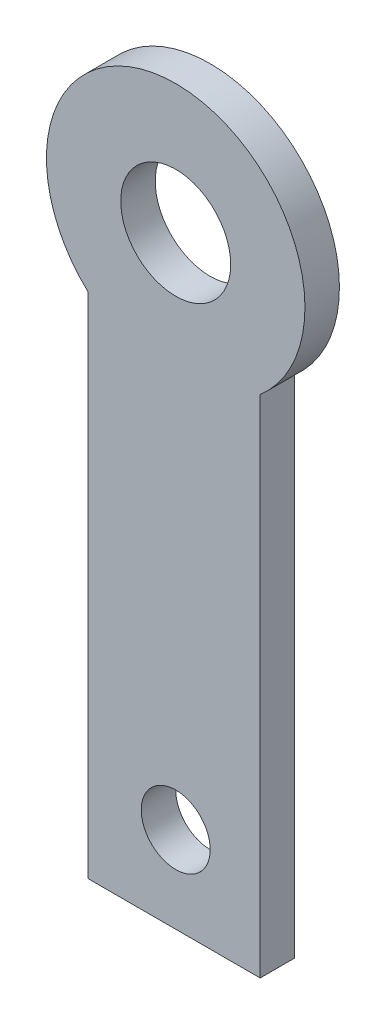
ISO-10303-21;
HEADER;
FILE_DESCRIPTION(('STEP AP214'),'2;1');
FILE_NAME('part.step','',(''),(''),'','','');
FILE_SCHEMA(('AUTOMOTIVE_DESIGN { 1 0 10303 214 1 1 1 1 }'));
ENDSEC;
DATA;
#1=APPLICATION_CONTEXT('core data for automotive mechanical design processes');
#2=APPLICATION_PROTOCOL_DEFINITION('international standard','automotive_design',2000,#1);
#3=PRODUCT_CONTEXT('',#1,'mechanical');
#4=PRODUCT('Part','Part','',(#3));
#5=PRODUCT_RELATED_PRODUCT_CATEGORY('part','',(#4));
#6=PRODUCT_DEFINITION_FORMATION('','',#4);
#7=PRODUCT_DEFINITION_CONTEXT('part definition',#1,'design');
#8=PRODUCT_DEFINITION('design','',#6,#7);
#9=PRODUCT_DEFINITION_SHAPE('','',#8);
#10=(LENGTH_UNIT() NAMED_UNIT(*) SI_UNIT(.MILLI.,.METRE.));
#11=(NAMED_UNIT(*) PLANE_ANGLE_UNIT() SI_UNIT($,.RADIAN.));
#12=(NAMED_UNIT(*) SI_UNIT($,.STERADIAN.) SOLID_ANGLE_UNIT());
#13=UNCERTAINTY_MEASURE_WITH_UNIT(LENGTH_MEASURE(1.E-05),#10,'distance_accuracy_value','');
#14=(GEOMETRIC_REPRESENTATION_CONTEXT(3) GLOBAL_UNCERTAINTY_ASSIGNED_CONTEXT((#13)) GLOBAL_UNIT_ASSIGNED_CONTEXT((#10,
#11,#12)) REPRESENTATION_CONTEXT('',''));
#15=CARTESIAN_POINT('',(0.,0.,0.));
#16=DIRECTION('',(0.,0.,1.));
#17=DIRECTION('',(1.,0.,0.));
#18=AXIS2_PLACEMENT_3D('',#15,#16,#17);
#19=CARTESIAN_POINT('',(15.5,8.,1.));
#20=DIRECTION('',(0.,0.,-1.));
#21=DIRECTION('',(-1.,0.,0.));
#22=AXIS2_PLACEMENT_3D('',#19,#20,#21);
#23=PLANE('',#22);
#24=CARTESIAN_POINT('',(15.5,8.,1.));
#25=DIRECTION('',(0.,0.,1.));
#26=DIRECTION('',(-1.,0.,0.));
#27=AXIS2_PLACEMENT_3D('',#24,#25,#26);
#28=CIRCLE('',#27,3.75);
#29=CARTESIAN_POINT('',(17.9502977305398,5.16124304814384,1.));
#30=VERTEX_POINT('',#29);
#31=CARTESIAN_POINT('',(12.9502977305398,5.25017848995442,1.));
#32=VERTEX_POINT('',#31);
#33=EDGE_CURVE('E87',#30,#32,#28,.T.);
#34=ORIENTED_EDGE('',*,*,#33,.T.);
#35=DIRECTION('',(0.,-1.,0.));
#36=VECTOR('',#35,1.);
#37=CARTESIAN_POINT('',(12.9502977305398,5.25017848995442,1.));
#38=LINE('',#37,#36);
#39=CARTESIAN_POINT('',(12.9502977305398,-9.5,1.));
#40=VERTEX_POINT('',#39);
#41=EDGE_CURVE('E82',#32,#40,#38,.T.);
#42=ORIENTED_EDGE('',*,*,#41,.T.);
#43=DIRECTION('',(1.,0.,0.));
#44=VECTOR('',#43,1.);
#45=CARTESIAN_POINT('',(12.9502977305398,-9.5,1.));
#46=LINE('',#45,#44);
#47=CARTESIAN_POINT('',(17.9502977305398,-9.5,1.));
#48=VERTEX_POINT('',#47);
#49=EDGE_CURVE('E85',#40,#48,#46,.T.);
#50=ORIENTED_EDGE('',*,*,#49,.T.);
#51=DIRECTION('',(0.,1.,0.));
#52=VECTOR('',#51,1.);
#53=CARTESIAN_POINT('',(17.9502977305398,-9.5,1.));
#54=LINE('',#53,#52);
#55=EDGE_CURVE('E52',#48,#30,#54,.T.);
#56=ORIENTED_EDGE('',*,*,#55,.T.);
#57=EDGE_LOOP('',(#34,#42,#50,#56));
#58=FACE_BOUND('',#57,.T.);
#59=CARTESIAN_POINT('',(15.5,8.,1.));
#60=DIRECTION('',(0.,0.,1.));
#61=DIRECTION('',(1.,0.,0.));
#62=AXIS2_PLACEMENT_3D('',#59,#60,#61);
#63=CIRCLE('',#62,1.595);
#64=CARTESIAN_POINT('',(17.095,8.,1.));
#65=VERTEX_POINT('',#64);
#66=EDGE_CURVE('E102',#65,#65,#63,.T.);
#67=ORIENTED_EDGE('',*,*,#66,.F.);
#68=EDGE_LOOP('',(#67));
#69=FACE_BOUND('',#68,.T.);
#70=CARTESIAN_POINT('',(15.5,-7.,1.));
#71=DIRECTION('',(0.,0.,1.));
#72=DIRECTION('',(1.,0.,0.));
#73=AXIS2_PLACEMENT_3D('',#70,#71,#72);
#74=CIRCLE('',#73,1.);
#75=CARTESIAN_POINT('',(16.5,-7.,1.));
#76=VERTEX_POINT('',#75);
#77=EDGE_CURVE('E117',#76,#76,#74,.T.);
#78=ORIENTED_EDGE('',*,*,#77,.F.);
#79=EDGE_LOOP('',(#78));
#80=FACE_BOUND('',#79,.T.);
#81=ADVANCED_FACE('F35',(#58,#69,#80),#23,.F.);
#82=CARTESIAN_POINT('',(15.5,8.,0.));
#83=DIRECTION('',(0.,0.,-1.));
#84=DIRECTION('',(-1.,0.,0.));
#85=AXIS2_PLACEMENT_3D('',#82,#83,#84);
#86=PLANE('',#85);
#87=CARTESIAN_POINT('',(15.5,8.,0.));
#88=DIRECTION('',(0.,0.,1.));
#89=DIRECTION('',(1.,0.,0.));
#90=AXIS2_PLACEMENT_3D('',#87,#88,#89);
#91=CIRCLE('',#90,1.595);
#92=CARTESIAN_POINT('',(17.095,8.,0.));
#93=VERTEX_POINT('',#92);
#94=EDGE_CURVE('E114',#93,#93,#91,.T.);
#95=ORIENTED_EDGE('',*,*,#94,.T.);
#96=EDGE_LOOP('',(#95));
#97=FACE_BOUND('',#96,.T.);
#98=CARTESIAN_POINT('',(15.5,8.,0.));
#99=DIRECTION('',(0.,0.,1.));
#100=DIRECTION('',(-1.,0.,0.));
#101=AXIS2_PLACEMENT_3D('',#98,#99,#100);
#102=CIRCLE('',#101,3.75);
#103=CARTESIAN_POINT('',(17.9502977305398,5.16124304814384,0.));
#104=VERTEX_POINT('',#103);
#105=CARTESIAN_POINT('',(12.9502977305398,5.25017848995442,0.));
#106=VERTEX_POINT('',#105);
#107=EDGE_CURVE('E99',#104,#106,#102,.T.);
#108=ORIENTED_EDGE('',*,*,#107,.F.);
#109=DIRECTION('',(0.,1.,0.));
#110=VECTOR('',#109,1.);
#111=CARTESIAN_POINT('',(17.9502977305398,-9.5,0.));
#112=LINE('',#111,#110);
#113=CARTESIAN_POINT('',(17.9502977305398,-9.5,0.));
#114=VERTEX_POINT('',#113);
#115=EDGE_CURVE('E75',#114,#104,#112,.T.);
#116=ORIENTED_EDGE('',*,*,#115,.F.);
#117=DIRECTION('',(1.,0.,0.));
#118=VECTOR('',#117,1.);
#119=CARTESIAN_POINT('',(12.9502977305398,-9.5,0.));
#120=LINE('',#119,#118);
#121=CARTESIAN_POINT('',(12.9502977305398,-9.5,0.));
#122=VERTEX_POINT('',#121);
#123=EDGE_CURVE('E69',#122,#114,#120,.T.);
#124=ORIENTED_EDGE('',*,*,#123,.F.);
#125=DIRECTION('',(0.,-1.,0.));
#126=VECTOR('',#125,1.);
#127=CARTESIAN_POINT('',(12.9502977305398,5.25017848995442,0.));
#128=LINE('',#127,#126);
#129=EDGE_CURVE('E91',#106,#122,#128,.T.);
#130=ORIENTED_EDGE('',*,*,#129,.F.);
#131=EDGE_LOOP('',(#108,#116,#124,#130));
#132=FACE_BOUND('',#131,.T.);
#133=CARTESIAN_POINT('',(15.5,-7.,0.));
#134=DIRECTION('',(0.,0.,1.));
#135=DIRECTION('',(1.,0.,0.));
#136=AXIS2_PLACEMENT_3D('',#133,#134,#135);
#137=CIRCLE('',#136,1.);
#138=CARTESIAN_POINT('',(16.5,-7.,0.));
#139=VERTEX_POINT('',#138);
#140=EDGE_CURVE('E120',#139,#139,#137,.T.);
#141=ORIENTED_EDGE('',*,*,#140,.T.);
#142=EDGE_LOOP('',(#141));
#143=FACE_BOUND('',#142,.T.);
#144=ADVANCED_FACE('F110',(#97,#132,#143),#86,.T.);
#145=CARTESIAN_POINT('',(15.5,8.,1.));
#146=DIRECTION('',(0.,0.,-1.));
#147=DIRECTION('',(-1.,0.,0.));
#148=AXIS2_PLACEMENT_3D('',#145,#146,#147);
#149=CYLINDRICAL_SURFACE('',#148,3.75);
#150=ORIENTED_EDGE('',*,*,#107,.T.);
#151=DIRECTION('',(0.,0.,-1.));
#152=VECTOR('',#151,1.);
#153=CARTESIAN_POINT('',(12.9502977305398,5.25017848995442,1.));
#154=LINE('',#153,#152);
#155=EDGE_CURVE('E11',#32,#106,#154,.T.);
#156=ORIENTED_EDGE('',*,*,#155,.F.);
#157=ORIENTED_EDGE('',*,*,#33,.F.);
#158=DIRECTION('',(0.,0.,-1.));
#159=VECTOR('',#158,1.);
#160=CARTESIAN_POINT('',(17.9502977305398,5.16124304814384,1.));
#161=LINE('',#160,#159);
#162=EDGE_CURVE('E95',#30,#104,#161,.T.);
#163=ORIENTED_EDGE('',*,*,#162,.T.);
#164=EDGE_LOOP('',(#150,#156,#157,#163));
#165=FACE_BOUND('',#164,.T.);
#166=ADVANCED_FACE('F37',(#165),#149,.T.);
#167=CARTESIAN_POINT('',(12.9502977305398,5.25017848995442,1.));
#168=DIRECTION('',(1.,0.,0.));
#169=DIRECTION('',(0.,1.,0.));
#170=AXIS2_PLACEMENT_3D('',#167,#168,#169);
#171=PLANE('',#170);
#172=ORIENTED_EDGE('',*,*,#129,.T.);
#173=DIRECTION('',(0.,0.,-1.));
#174=VECTOR('',#173,1.);
#175=CARTESIAN_POINT('',(12.9502977305398,-9.5,1.));
#176=LINE('',#175,#174);
#177=EDGE_CURVE('E44',#40,#122,#176,.T.);
#178=ORIENTED_EDGE('',*,*,#177,.F.);
#179=ORIENTED_EDGE('',*,*,#41,.F.);
#180=ORIENTED_EDGE('',*,*,#155,.T.);
#181=EDGE_LOOP('',(#172,#178,#179,#180));
#182=FACE_BOUND('',#181,.T.);
#183=ADVANCED_FACE('F90',(#182),#171,.F.);
#184=CARTESIAN_POINT('',(12.9502977305398,-9.5,1.));
#185=DIRECTION('',(0.,1.,0.));
#186=DIRECTION('',(0.,0.,1.));
#187=AXIS2_PLACEMENT_3D('',#184,#185,#186);
#188=PLANE('',#187);
#189=ORIENTED_EDGE('',*,*,#123,.T.);
#190=DIRECTION('',(0.,0.,-1.));
#191=VECTOR('',#190,1.);
#192=CARTESIAN_POINT('',(17.9502977305398,-9.5,1.));
#193=LINE('',#192,#191);
#194=EDGE_CURVE('E92',#48,#114,#193,.T.);
#195=ORIENTED_EDGE('',*,*,#194,.F.);
#196=ORIENTED_EDGE('',*,*,#49,.F.);
#197=ORIENTED_EDGE('',*,*,#177,.T.);
#198=EDGE_LOOP('',(#189,#195,#196,#197));
#199=FACE_BOUND('',#198,.T.);
#200=ADVANCED_FACE('F93',(#199),#188,.F.);
#201=CARTESIAN_POINT('',(17.9502977305398,-9.5,1.));
#202=DIRECTION('',(-1.,0.,0.));
#203=DIRECTION('',(0.,0.,1.));
#204=AXIS2_PLACEMENT_3D('',#201,#202,#203);
#205=PLANE('',#204);
#206=ORIENTED_EDGE('',*,*,#115,.T.);
#207=ORIENTED_EDGE('',*,*,#162,.F.);
#208=ORIENTED_EDGE('',*,*,#55,.F.);
#209=ORIENTED_EDGE('',*,*,#194,.T.);
#210=EDGE_LOOP('',(#206,#207,#208,#209));
#211=FACE_BOUND('',#210,.T.);
#212=ADVANCED_FACE('F107',(#211),#205,.F.);
#213=CARTESIAN_POINT('',(15.5,8.,1.));
#214=DIRECTION('',(0.,0.,-1.));
#215=DIRECTION('',(-1.,0.,0.));
#216=AXIS2_PLACEMENT_3D('',#213,#214,#215);
#217=CYLINDRICAL_SURFACE('',#216,1.595);
#218=ORIENTED_EDGE('',*,*,#66,.T.);
#219=EDGE_LOOP('',(#218));
#220=FACE_BOUND('',#219,.T.);
#221=ORIENTED_EDGE('',*,*,#94,.F.);
#222=EDGE_LOOP('',(#221));
#223=FACE_BOUND('',#222,.T.);
#224=ADVANCED_FACE('F137',(#220,#223),#217,.F.);
#225=CARTESIAN_POINT('',(15.5,-7.,1.));
#226=DIRECTION('',(0.,0.,-1.));
#227=DIRECTION('',(-1.,0.,0.));
#228=AXIS2_PLACEMENT_3D('',#225,#226,#227);
#229=CYLINDRICAL_SURFACE('',#228,1.);
#230=ORIENTED_EDGE('',*,*,#77,.T.);
#231=EDGE_LOOP('',(#230));
#232=FACE_BOUND('',#231,.T.);
#233=ORIENTED_EDGE('',*,*,#140,.F.);
#234=EDGE_LOOP('',(#233));
#235=FACE_BOUND('',#234,.T.);
#236=ADVANCED_FACE('F126',(#232,#235),#229,.F.);
#237=CLOSED_SHELL('',(#81,#144,#166,#183,#200,#212,#224,#236));
#238=MANIFOLD_SOLID_BREP('B2',#237);
#239=ADVANCED_BREP_SHAPE_REPRESENTATION('',(#18,#238),#14);
#240=SHAPE_DEFINITION_REPRESENTATION(#9,#239);
ENDSEC;
END-ISO-10303-21;
